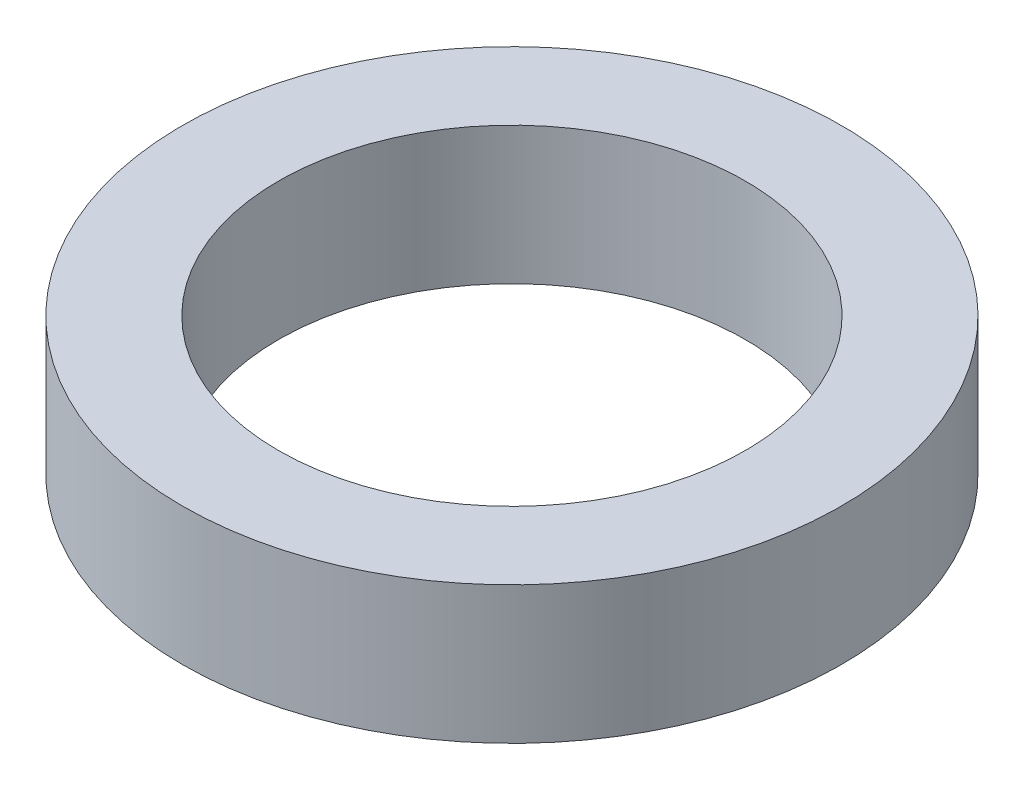
ISO-10303-21;
HEADER;
FILE_DESCRIPTION(('STEP AP214'),'2;1');
FILE_NAME('part.step','',(''),(''),'','','');
FILE_SCHEMA(('AUTOMOTIVE_DESIGN { 1 0 10303 214 1 1 1 1 }'));
ENDSEC;
DATA;
#1=APPLICATION_CONTEXT('core data for automotive mechanical design processes');
#2=APPLICATION_PROTOCOL_DEFINITION('international standard','automotive_design',2000,#1);
#3=PRODUCT_CONTEXT('',#1,'mechanical');
#4=PRODUCT('Part','Part','',(#3));
#5=PRODUCT_RELATED_PRODUCT_CATEGORY('part','',(#4));
#6=PRODUCT_DEFINITION_FORMATION('','',#4);
#7=PRODUCT_DEFINITION_CONTEXT('part definition',#1,'design');
#8=PRODUCT_DEFINITION('design','',#6,#7);
#9=PRODUCT_DEFINITION_SHAPE('','',#8);
#10=(LENGTH_UNIT() NAMED_UNIT(*) SI_UNIT(.MILLI.,.METRE.));
#11=(NAMED_UNIT(*) PLANE_ANGLE_UNIT() SI_UNIT($,.RADIAN.));
#12=(NAMED_UNIT(*) SI_UNIT($,.STERADIAN.) SOLID_ANGLE_UNIT());
#13=UNCERTAINTY_MEASURE_WITH_UNIT(LENGTH_MEASURE(1.E-05),#10,'distance_accuracy_value','');
#14=(GEOMETRIC_REPRESENTATION_CONTEXT(3) GLOBAL_UNCERTAINTY_ASSIGNED_CONTEXT((#13)) GLOBAL_UNIT_ASSIGNED_CONTEXT((#10,
#11,#12)) REPRESENTATION_CONTEXT('',''));
#15=CARTESIAN_POINT('',(0.,0.,0.));
#16=DIRECTION('',(0.,0.,1.));
#17=DIRECTION('',(1.,0.,0.));
#18=AXIS2_PLACEMENT_3D('',#15,#16,#17);
#19=CARTESIAN_POINT('',(0.,25.,0.));
#20=DIRECTION('',(0.,-1.,0.));
#21=DIRECTION('',(0.,0.,-1.));
#22=AXIS2_PLACEMENT_3D('',#19,#20,#21);
#23=CYLINDRICAL_SURFACE('',#22,60.);
#24=CARTESIAN_POINT('',(0.,25.,0.));
#25=DIRECTION('',(0.,1.,0.));
#26=DIRECTION('',(0.,0.,1.));
#27=AXIS2_PLACEMENT_3D('',#24,#25,#26);
#28=CIRCLE('',#27,60.);
#29=CARTESIAN_POINT('',(0.,25.,60.));
#30=VERTEX_POINT('',#29);
#31=EDGE_CURVE('E10',#30,#30,#28,.T.);
#32=ORIENTED_EDGE('',*,*,#31,.F.);
#33=EDGE_LOOP('',(#32));
#34=FACE_BOUND('',#33,.T.);
#35=CARTESIAN_POINT('',(0.,0.,0.));
#36=DIRECTION('',(0.,1.,0.));
#37=DIRECTION('',(0.,0.,1.));
#38=AXIS2_PLACEMENT_3D('',#35,#36,#37);
#39=CIRCLE('',#38,60.);
#40=CARTESIAN_POINT('',(0.,0.,60.));
#41=VERTEX_POINT('',#40);
#42=EDGE_CURVE('E37',#41,#41,#39,.T.);
#43=ORIENTED_EDGE('',*,*,#42,.T.);
#44=EDGE_LOOP('',(#43));
#45=FACE_BOUND('',#44,.T.);
#46=ADVANCED_FACE('F40',(#34,#45),#23,.T.);
#47=CARTESIAN_POINT('',(0.,25.,0.));
#48=DIRECTION('',(0.,1.,0.));
#49=DIRECTION('',(0.,0.,1.));
#50=AXIS2_PLACEMENT_3D('',#47,#48,#49);
#51=PLANE('',#50);
#52=CARTESIAN_POINT('',(0.,25.,0.));
#53=DIRECTION('',(0.,1.,0.));
#54=DIRECTION('',(0.,0.,1.));
#55=AXIS2_PLACEMENT_3D('',#52,#53,#54);
#56=CIRCLE('',#55,42.5);
#57=CARTESIAN_POINT('',(0.,25.,42.5));
#58=VERTEX_POINT('',#57);
#59=EDGE_CURVE('E50',#58,#58,#56,.T.);
#60=ORIENTED_EDGE('',*,*,#59,.F.);
#61=EDGE_LOOP('',(#60));
#62=FACE_BOUND('',#61,.T.);
#63=ORIENTED_EDGE('',*,*,#31,.T.);
#64=EDGE_LOOP('',(#63));
#65=FACE_BOUND('',#64,.T.);
#66=ADVANCED_FACE('F59',(#62,#65),#51,.T.);
#67=CARTESIAN_POINT('',(0.,0.,0.));
#68=DIRECTION('',(0.,1.,0.));
#69=DIRECTION('',(0.,0.,1.));
#70=AXIS2_PLACEMENT_3D('',#67,#68,#69);
#71=PLANE('',#70);
#72=CARTESIAN_POINT('',(0.,0.,0.));
#73=DIRECTION('',(0.,1.,0.));
#74=DIRECTION('',(0.,0.,1.));
#75=AXIS2_PLACEMENT_3D('',#72,#73,#74);
#76=CIRCLE('',#75,42.5);
#77=CARTESIAN_POINT('',(0.,0.,42.5));
#78=VERTEX_POINT('',#77);
#79=EDGE_CURVE('E47',#78,#78,#76,.T.);
#80=ORIENTED_EDGE('',*,*,#79,.T.);
#81=EDGE_LOOP('',(#80));
#82=FACE_BOUND('',#81,.T.);
#83=ORIENTED_EDGE('',*,*,#42,.F.);
#84=EDGE_LOOP('',(#83));
#85=FACE_BOUND('',#84,.T.);
#86=ADVANCED_FACE('F58',(#82,#85),#71,.F.);
#87=CARTESIAN_POINT('',(0.,25.,0.));
#88=DIRECTION('',(0.,-1.,0.));
#89=DIRECTION('',(0.,0.,-1.));
#90=AXIS2_PLACEMENT_3D('',#87,#88,#89);
#91=CYLINDRICAL_SURFACE('',#90,42.5);
#92=ORIENTED_EDGE('',*,*,#59,.T.);
#93=EDGE_LOOP('',(#92));
#94=FACE_BOUND('',#93,.T.);
#95=ORIENTED_EDGE('',*,*,#79,.F.);
#96=EDGE_LOOP('',(#95));
#97=FACE_BOUND('',#96,.T.);
#98=ADVANCED_FACE('F54',(#94,#97),#91,.F.);
#99=CLOSED_SHELL('',(#46,#66,#86,#98));
#100=MANIFOLD_SOLID_BREP('B2',#99);
#101=ADVANCED_BREP_SHAPE_REPRESENTATION('',(#18,#100),#14);
#102=SHAPE_DEFINITION_REPRESENTATION(#9,#101);
ENDSEC;
END-ISO-10303-21;
